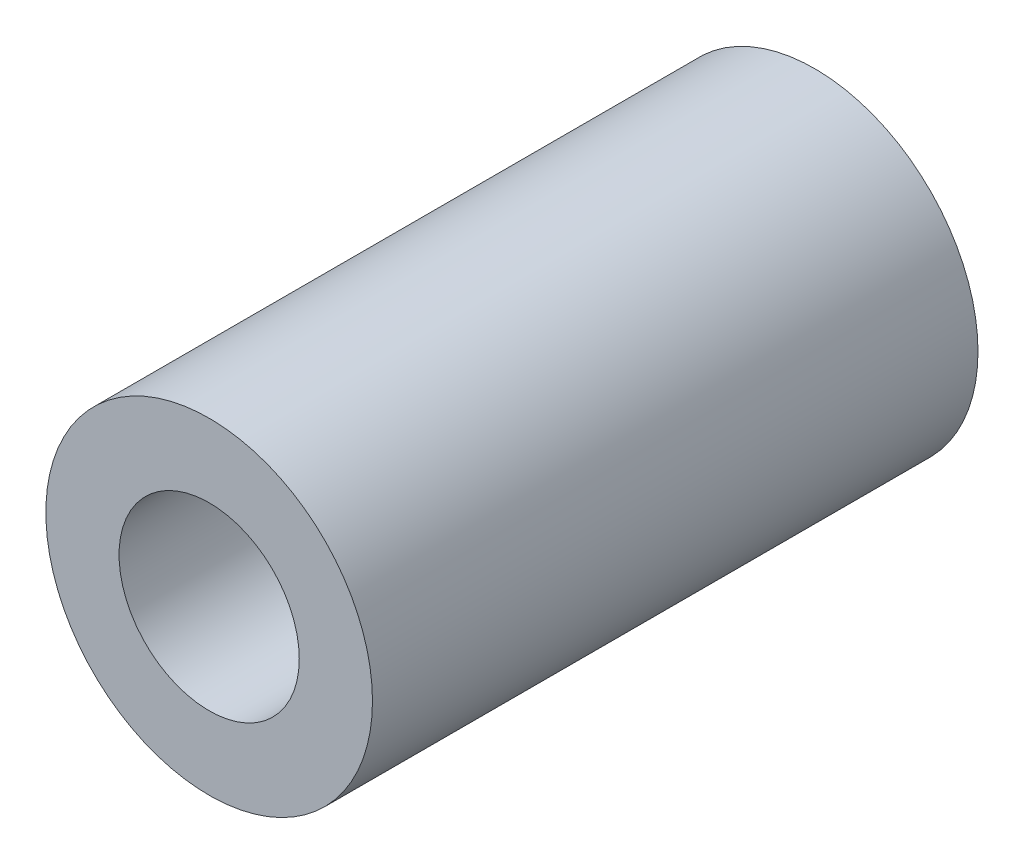
ISO-10303-21;
HEADER;
FILE_DESCRIPTION(('STEP AP214'),'2;1');
FILE_NAME('part.step','',(''),(''),'','','');
FILE_SCHEMA(('AUTOMOTIVE_DESIGN { 1 0 10303 214 1 1 1 1 }'));
ENDSEC;
DATA;
#1=APPLICATION_CONTEXT('core data for automotive mechanical design processes');
#2=APPLICATION_PROTOCOL_DEFINITION('international standard','automotive_design',2000,#1);
#3=PRODUCT_CONTEXT('',#1,'mechanical');
#4=PRODUCT('Part','Part','',(#3));
#5=PRODUCT_RELATED_PRODUCT_CATEGORY('part','',(#4));
#6=PRODUCT_DEFINITION_FORMATION('','',#4);
#7=PRODUCT_DEFINITION_CONTEXT('part definition',#1,'design');
#8=PRODUCT_DEFINITION('design','',#6,#7);
#9=PRODUCT_DEFINITION_SHAPE('','',#8);
#10=(LENGTH_UNIT() NAMED_UNIT(*) SI_UNIT(.MILLI.,.METRE.));
#11=(NAMED_UNIT(*) PLANE_ANGLE_UNIT() SI_UNIT($,.RADIAN.));
#12=(NAMED_UNIT(*) SI_UNIT($,.STERADIAN.) SOLID_ANGLE_UNIT());
#13=UNCERTAINTY_MEASURE_WITH_UNIT(LENGTH_MEASURE(1.E-05),#10,'distance_accuracy_value','');
#14=(GEOMETRIC_REPRESENTATION_CONTEXT(3) GLOBAL_UNCERTAINTY_ASSIGNED_CONTEXT((#13)) GLOBAL_UNIT_ASSIGNED_CONTEXT((#10,
#11,#12)) REPRESENTATION_CONTEXT('',''));
#15=CARTESIAN_POINT('',(0.,0.,0.));
#16=DIRECTION('',(0.,0.,1.));
#17=DIRECTION('',(1.,0.,0.));
#18=AXIS2_PLACEMENT_3D('',#15,#16,#17);
#19=CARTESIAN_POINT('',(0.,0.,42.672));
#20=DIRECTION('',(0.,0.,-1.));
#21=DIRECTION('',(-1.,0.,0.));
#22=AXIS2_PLACEMENT_3D('',#19,#20,#21);
#23=CYLINDRICAL_SURFACE('',#22,11.509375);
#24=CARTESIAN_POINT('',(0.,0.,42.672));
#25=DIRECTION('',(0.,0.,1.));
#26=DIRECTION('',(1.,0.,0.));
#27=AXIS2_PLACEMENT_3D('',#24,#25,#26);
#28=CIRCLE('',#27,11.509375);
#29=CARTESIAN_POINT('',(11.509375,0.,42.672));
#30=VERTEX_POINT('',#29);
#31=EDGE_CURVE('E10',#30,#30,#28,.T.);
#32=ORIENTED_EDGE('',*,*,#31,.F.);
#33=EDGE_LOOP('',(#32));
#34=FACE_BOUND('',#33,.T.);
#35=CARTESIAN_POINT('',(0.,0.,0.));
#36=DIRECTION('',(0.,0.,1.));
#37=DIRECTION('',(1.,0.,0.));
#38=AXIS2_PLACEMENT_3D('',#35,#36,#37);
#39=CIRCLE('',#38,11.509375);
#40=CARTESIAN_POINT('',(11.509375,0.,0.));
#41=VERTEX_POINT('',#40);
#42=EDGE_CURVE('E34',#41,#41,#39,.T.);
#43=ORIENTED_EDGE('',*,*,#42,.T.);
#44=EDGE_LOOP('',(#43));
#45=FACE_BOUND('',#44,.T.);
#46=ADVANCED_FACE('F31',(#34,#45),#23,.T.);
#47=CARTESIAN_POINT('',(0.,0.,42.672));
#48=DIRECTION('',(0.,0.,1.));
#49=DIRECTION('',(1.,0.,0.));
#50=AXIS2_PLACEMENT_3D('',#47,#48,#49);
#51=PLANE('',#50);
#52=CARTESIAN_POINT('',(0.,0.,42.672));
#53=DIRECTION('',(0.,0.,1.));
#54=DIRECTION('',(1.,0.,0.));
#55=AXIS2_PLACEMENT_3D('',#52,#53,#54);
#56=CIRCLE('',#55,6.35);
#57=CARTESIAN_POINT('',(6.35,0.,42.672));
#58=VERTEX_POINT('',#57);
#59=EDGE_CURVE('E41',#58,#58,#56,.T.);
#60=ORIENTED_EDGE('',*,*,#59,.F.);
#61=EDGE_LOOP('',(#60));
#62=FACE_BOUND('',#61,.T.);
#63=ORIENTED_EDGE('',*,*,#31,.T.);
#64=EDGE_LOOP('',(#63));
#65=FACE_BOUND('',#64,.T.);
#66=ADVANCED_FACE('F59',(#62,#65),#51,.T.);
#67=CARTESIAN_POINT('',(0.,0.,0.));
#68=DIRECTION('',(0.,0.,1.));
#69=DIRECTION('',(1.,0.,0.));
#70=AXIS2_PLACEMENT_3D('',#67,#68,#69);
#71=PLANE('',#70);
#72=CARTESIAN_POINT('',(0.,0.,0.));
#73=DIRECTION('',(0.,0.,1.));
#74=DIRECTION('',(1.,0.,0.));
#75=AXIS2_PLACEMENT_3D('',#72,#73,#74);
#76=CIRCLE('',#75,6.35);
#77=CARTESIAN_POINT('',(6.35,0.,0.));
#78=VERTEX_POINT('',#77);
#79=EDGE_CURVE('E45',#78,#78,#76,.T.);
#80=ORIENTED_EDGE('',*,*,#79,.T.);
#81=EDGE_LOOP('',(#80));
#82=FACE_BOUND('',#81,.T.);
#83=ORIENTED_EDGE('',*,*,#42,.F.);
#84=EDGE_LOOP('',(#83));
#85=FACE_BOUND('',#84,.T.);
#86=ADVANCED_FACE('F49',(#82,#85),#71,.F.);
#87=CARTESIAN_POINT('',(0.,0.,0.));
#88=DIRECTION('',(0.,0.,1.));
#89=DIRECTION('',(1.,0.,0.));
#90=AXIS2_PLACEMENT_3D('',#87,#88,#89);
#91=CYLINDRICAL_SURFACE('',#90,6.35);
#92=ORIENTED_EDGE('',*,*,#59,.T.);
#93=EDGE_LOOP('',(#92));
#94=FACE_BOUND('',#93,.T.);
#95=ORIENTED_EDGE('',*,*,#79,.F.);
#96=EDGE_LOOP('',(#95));
#97=FACE_BOUND('',#96,.T.);
#98=ADVANCED_FACE('F52',(#94,#97),#91,.F.);
#99=CLOSED_SHELL('',(#46,#66,#86,#98));
#100=MANIFOLD_SOLID_BREP('B2',#99);
#101=ADVANCED_BREP_SHAPE_REPRESENTATION('',(#18,#100),#14);
#102=SHAPE_DEFINITION_REPRESENTATION(#9,#101);
ENDSEC;
END-ISO-10303-21;
